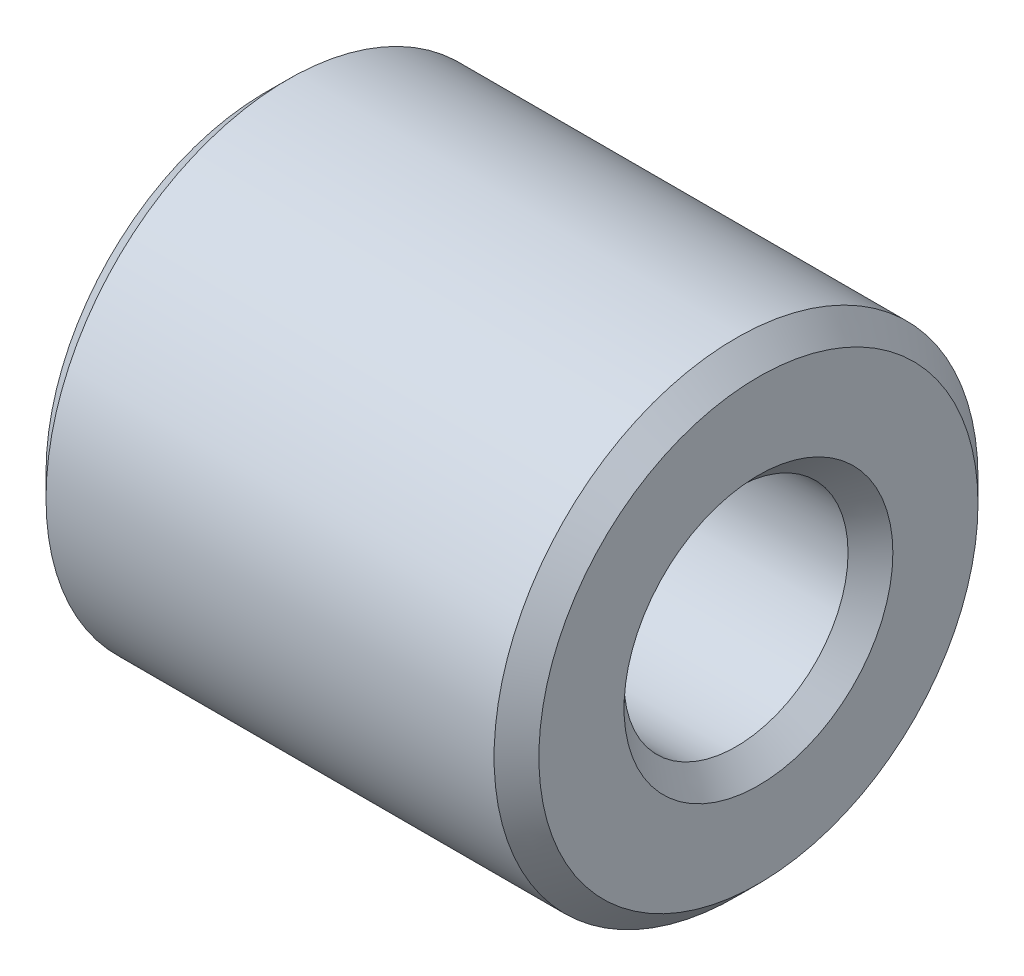
ISO-10303-21;
HEADER;
FILE_DESCRIPTION(('STEP AP214'),'2;1');
FILE_NAME('part.step','',(''),(''),'','','');
FILE_SCHEMA(('AUTOMOTIVE_DESIGN { 1 0 10303 214 1 1 1 1 }'));
ENDSEC;
DATA;
#1=APPLICATION_CONTEXT('core data for automotive mechanical design processes');
#2=APPLICATION_PROTOCOL_DEFINITION('international standard','automotive_design',2000,#1);
#3=PRODUCT_CONTEXT('',#1,'mechanical');
#4=PRODUCT('Part','Part','',(#3));
#5=PRODUCT_RELATED_PRODUCT_CATEGORY('part','',(#4));
#6=PRODUCT_DEFINITION_FORMATION('','',#4);
#7=PRODUCT_DEFINITION_CONTEXT('part definition',#1,'design');
#8=PRODUCT_DEFINITION('design','',#6,#7);
#9=PRODUCT_DEFINITION_SHAPE('','',#8);
#10=(LENGTH_UNIT() NAMED_UNIT(*) SI_UNIT(.MILLI.,.METRE.));
#11=(NAMED_UNIT(*) PLANE_ANGLE_UNIT() SI_UNIT($,.RADIAN.));
#12=(NAMED_UNIT(*) SI_UNIT($,.STERADIAN.) SOLID_ANGLE_UNIT());
#13=UNCERTAINTY_MEASURE_WITH_UNIT(LENGTH_MEASURE(1.E-05),#10,'distance_accuracy_value','');
#14=(GEOMETRIC_REPRESENTATION_CONTEXT(3) GLOBAL_UNCERTAINTY_ASSIGNED_CONTEXT((#13)) GLOBAL_UNIT_ASSIGNED_CONTEXT((#10,
#11,#12)) REPRESENTATION_CONTEXT('',''));
#15=CARTESIAN_POINT('',(0.,0.,0.));
#16=DIRECTION('',(0.,0.,1.));
#17=DIRECTION('',(1.,0.,0.));
#18=AXIS2_PLACEMENT_3D('',#15,#16,#17);
#19=CARTESIAN_POINT('',(-5.5,5.40000000000873,0.));
#20=DIRECTION('',(-1.,0.,0.));
#21=DIRECTION('',(0.,0.,1.));
#22=AXIS2_PLACEMENT_3D('',#19,#20,#21);
#23=PLANE('',#22);
#24=CARTESIAN_POINT('',(-5.5,0.,0.));
#25=DIRECTION('',(-1.,0.,0.));
#26=DIRECTION('',(0.,0.,1.));
#27=AXIS2_PLACEMENT_3D('',#24,#25,#26);
#28=CIRCLE('',#27,4.90000000000872);
#29=CARTESIAN_POINT('',(-5.5,0.,4.90000000000872));
#30=VERTEX_POINT('',#29);
#31=EDGE_CURVE('E50',#30,#30,#28,.T.);
#32=ORIENTED_EDGE('',*,*,#31,.T.);
#33=EDGE_LOOP('',(#32));
#34=FACE_BOUND('',#33,.T.);
#35=CARTESIAN_POINT('',(-5.5,0.,0.));
#36=DIRECTION('',(-1.,0.,0.));
#37=DIRECTION('',(0.,0.,1.));
#38=AXIS2_PLACEMENT_3D('',#35,#36,#37);
#39=CIRCLE('',#38,3.);
#40=CARTESIAN_POINT('',(-5.5,0.,3.));
#41=VERTEX_POINT('',#40);
#42=EDGE_CURVE('E53',#41,#41,#39,.F.);
#43=ORIENTED_EDGE('',*,*,#42,.T.);
#44=EDGE_LOOP('',(#43));
#45=FACE_BOUND('',#44,.T.);
#46=ADVANCED_FACE('F30',(#34,#45),#23,.T.);
#47=CARTESIAN_POINT('',(0.,0.,0.));
#48=DIRECTION('',(1.,0.,0.));
#49=DIRECTION('',(0.,0.,-1.));
#50=AXIS2_PLACEMENT_3D('',#47,#48,#49);
#51=CYLINDRICAL_SURFACE('',#50,2.5);
#52=CARTESIAN_POINT('',(-5.,0.,0.));
#53=DIRECTION('',(-1.,0.,0.));
#54=DIRECTION('',(0.,0.,1.));
#55=AXIS2_PLACEMENT_3D('',#52,#53,#54);
#56=CIRCLE('',#55,2.5);
#57=CARTESIAN_POINT('',(-5.,0.,2.5));
#58=VERTEX_POINT('',#57);
#59=EDGE_CURVE('E10',#58,#58,#56,.T.);
#60=ORIENTED_EDGE('',*,*,#59,.T.);
#61=EDGE_LOOP('',(#60));
#62=FACE_BOUND('',#61,.T.);
#63=CARTESIAN_POINT('',(4.99999999999999,0.,0.));
#64=DIRECTION('',(1.,0.,0.));
#65=DIRECTION('',(0.,0.,-1.));
#66=AXIS2_PLACEMENT_3D('',#63,#64,#65);
#67=CIRCLE('',#66,2.5);
#68=CARTESIAN_POINT('',(4.99999999999999,0.,-2.5));
#69=VERTEX_POINT('',#68);
#70=EDGE_CURVE('E37',#69,#69,#67,.T.);
#71=ORIENTED_EDGE('',*,*,#70,.T.);
#72=EDGE_LOOP('',(#71));
#73=FACE_BOUND('',#72,.T.);
#74=CARTESIAN_POINT('',(-2.75,-2.,1.5));
#75=CARTESIAN_POINT('',(-2.67452102471036,-1.99999416642512,1.50000404108592));
#76=CARTESIAN_POINT('',(-2.5990615659202,-2.00433633903481,1.49426852824013));
#77=CARTESIAN_POINT('',(-2.45067609603778,-2.02092590613883,1.47174965152787));
#78=CARTESIAN_POINT('',(-2.3777528126149,-2.03318155043097,1.45495475788936));
#79=CARTESIAN_POINT('',(-2.23691635832272,-2.0636233903473,1.41143486335795));
#80=CARTESIAN_POINT('',(-2.16897116196473,-2.0817666618312,1.3847815450315));
#81=CARTESIAN_POINT('',(-2.03856254663208,-2.12185904995836,1.32252909283019));
#82=CARTESIAN_POINT('',(-1.97610077030486,-2.14380930122416,1.28692729054693));
#83=CARTESIAN_POINT('',(-1.85005098333591,-2.19228594587542,1.20271292747644));
#84=CARTESIAN_POINT('',(-1.78725904287605,-2.21904371037662,1.15304179435289));
#85=CARTESIAN_POINT('',(-1.67023523725824,-2.27226229431061,1.04426801309985));
#86=CARTESIAN_POINT('',(-1.61600984832919,-2.29872287517103,0.985158296729613));
#87=CARTESIAN_POINT('',(-1.5118661902903,-2.35175567858734,0.851442367411702));
#88=CARTESIAN_POINT('',(-1.46304553633025,-2.37803133577818,0.775851995162548));
#89=CARTESIAN_POINT('',(-1.37919027755556,-2.42443786983179,0.615654228271659));
#90=CARTESIAN_POINT('',(-1.34414302587728,-2.44457437988735,0.531055196626331));
#91=CARTESIAN_POINT('',(-1.29240407718735,-2.4747098780044,0.363771406742667));
#92=CARTESIAN_POINT('',(-1.2742796390327,-2.4854930393917,0.281674698130916));
#93=CARTESIAN_POINT('',(-1.25205719713688,-2.49874939277545,0.114970509382709));
#94=CARTESIAN_POINT('',(-1.24794602199994,-2.50123038813308,0.0303654624001538));
#95=CARTESIAN_POINT('',(-1.25361374734246,-2.49783372711539,-0.127637283737309));
#96=CARTESIAN_POINT('',(-1.26173352616931,-2.49295437513726,-0.201123832865634));
#97=CARTESIAN_POINT('',(-1.2884797956481,-2.47707997553857,-0.345464269151768));
#98=CARTESIAN_POINT('',(-1.30710706390715,-2.46608447529309,-0.416317961051201));
#99=CARTESIAN_POINT('',(-1.35416556270377,-2.4388490720172,-0.554056780469079));
#100=CARTESIAN_POINT('',(-1.38265306113899,-2.42257910450824,-0.620916491037617));
#101=CARTESIAN_POINT('',(-1.44838461622554,-2.38609637638748,-0.748988660115611));
#102=CARTESIAN_POINT('',(-1.48563094705901,-2.36588259201812,-0.810199646208011));
#103=CARTESIAN_POINT('',(-1.57283909280445,-2.32037925976363,-0.933074267143199));
#104=CARTESIAN_POINT('',(-1.62378831173573,-2.2947718295215,-0.993918663198193));
#105=CARTESIAN_POINT('',(-1.73440411786017,-2.24255554245601,-1.10671465909275));
#106=CARTESIAN_POINT('',(-1.7940825034745,-2.21594536703375,-1.1586540130834));
#107=CARTESIAN_POINT('',(-1.92865340616355,-2.16111075123946,-1.25824837767417));
#108=CARTESIAN_POINT('',(-2.00450757653946,-2.13305661385124,-1.30470933188632));
#109=CARTESIAN_POINT('',(-2.1647062316366,-2.08250879557267,-1.38397217194232));
#110=CARTESIAN_POINT('',(-2.24903471612564,-2.06000490298821,-1.41679921962189));
#111=CARTESIAN_POINT('',(-2.40239363189534,-2.02895865196732,-1.46077497064842));
#112=CARTESIAN_POINT('',(-2.47004063229664,-2.01833888618316,-1.47527903312665));
#113=CARTESIAN_POINT('',(-2.60737361029948,-2.00392150777558,-1.49480872755284));
#114=CARTESIAN_POINT('',(-2.67705712048456,-2.00011596115116,-1.49984538302907));
#115=CARTESIAN_POINT('',(-2.8165516824357,-1.99988914321323,-1.50014781114183));
#116=CARTESIAN_POINT('',(-2.88636277721521,-2.00347810223984,-1.49540004697659));
#117=CARTESIAN_POINT('',(-3.02398734374855,-2.01751520788652,-1.47640290574941));
#118=CARTESIAN_POINT('',(-3.09179919224025,-2.02796877613213,-1.46214601830139));
#119=CARTESIAN_POINT('',(-3.22371457947978,-2.05431768333101,-1.42488312618657));
#120=CARTESIAN_POINT('',(-3.28782263653223,-2.07020622092812,-1.40188805257362));
#121=CARTESIAN_POINT('',(-3.41147771573018,-2.10571539417587,-1.34796261057072));
#122=CARTESIAN_POINT('',(-3.471023006366,-2.12533743689999,-1.31702924888212));
#123=CARTESIAN_POINT('',(-3.59524008251224,-2.17036819177737,-1.24167439558512));
#124=CARTESIAN_POINT('',(-3.65890083509656,-2.19618239397369,-1.19582663060303));
#125=CARTESIAN_POINT('',(-3.77828548484946,-2.24821754803621,-1.09487395518701));
#126=CARTESIAN_POINT('',(-3.83400169216911,-2.27443886711455,-1.03976018672402));
#127=CARTESIAN_POINT('',(-3.94322400735042,-2.32835625910913,-0.913274837212767));
#128=CARTESIAN_POINT('',(-3.99550072660583,-2.3558007587587,-0.840721108780193));
#129=CARTESIAN_POINT('',(-4.08690277683665,-2.40537639133459,-0.686103100868021));
#130=CARTESIAN_POINT('',(-4.12603682784092,-2.42751104449411,-0.604045176134704));
#131=CARTESIAN_POINT('',(-4.18686820343136,-2.46252280092775,-0.43884023297214));
#132=CARTESIAN_POINT('',(-4.2096262277911,-2.47595588067329,-0.35620596365126));
#133=CARTESIAN_POINT('',(-4.24071460284625,-2.494407389061,-0.187383063890858));
#134=CARTESIAN_POINT('',(-4.24906129071762,-2.49943534582737,-0.10119857178197));
#135=CARTESIAN_POINT('',(-4.25067460858592,-2.50040600461976,0.0598120232009829));
#136=CARTESIAN_POINT('',(-4.24580333456303,-2.49747057186327,0.134620583589705));
#137=CARTESIAN_POINT('',(-4.22510617561838,-2.48512948412096,0.282148755978773));
#138=CARTESIAN_POINT('',(-4.2092801686784,-2.47572375706639,0.354868344701913));
#139=CARTESIAN_POINT('',(-4.16778042841621,-2.45149427526962,0.495145481978796));
#140=CARTESIAN_POINT('',(-4.14226840387075,-2.43675966858906,0.562767032608829));
#141=CARTESIAN_POINT('',(-4.08235940544524,-2.40303337447155,0.692781971999983));
#142=CARTESIAN_POINT('',(-4.0479604391404,-2.38404073252268,0.755174184199831));
#143=CARTESIAN_POINT('',(-3.96707480343124,-2.34093432659381,0.880263645295947));
#144=CARTESIAN_POINT('',(-3.91968129098313,-2.31648844639149,0.942258690439939));
#145=CARTESIAN_POINT('',(-3.81624696628227,-2.26601907350661,1.05789751536307));
#146=CARTESIAN_POINT('',(-3.76019657439209,-2.23999385274509,1.11153190956916));
#147=CARTESIAN_POINT('',(-3.6327144378223,-2.18528165666205,1.2159097535057));
#148=CARTESIAN_POINT('',(-3.5602335138345,-2.15667566270901,1.26542406663367));
#149=CARTESIAN_POINT('',(-3.40651514723346,-2.10376464485145,1.35156817210325));
#150=CARTESIAN_POINT('',(-3.32528228601858,-2.07945738811052,1.38820466322661));
#151=CARTESIAN_POINT('',(-3.1629357148628,-2.0408000304796,1.44437116535132));
#152=CARTESIAN_POINT('',(-3.08240476403875,-2.02577665830138,1.46509526060187));
#153=CARTESIAN_POINT('',(-2.91790260529632,-2.00539032320036,1.49289268240426));
#154=CARTESIAN_POINT('',(-2.83393923424129,-2.00000648744643,1.49999550595837));
#155=CARTESIAN_POINT('',(-2.75,-2.,1.5));
#156=B_SPLINE_CURVE_WITH_KNOTS('',3,(#74,#75,#76,#77,#78,#79,#80,#81,#82,#83,#84,#85,#86,#87,
#88,#89,#90,#91,#92,#93,#94,#95,#96,#97,#98,#99,#100,#101,#102,#103,#104,#105,#106,#107,#108,
#109,#110,#111,#112,#113,#114,#115,#116,#117,#118,#119,#120,#121,#122,#123,#124,#125,#126,#127,
#128,#129,#130,#131,#132,#133,#134,#135,#136,#137,#138,#139,#140,#141,#142,#143,#144,#145,#146,
#147,#148,#149,#150,#151,#152,#153,#154,#155),.UNSPECIFIED.,.T.,.F.,(4,2,2,2,2,2,2,2,2,2,2,2,2,
2,2,2,2,2,2,2,2,2,2,2,2,2,2,2,2,2,2,2,2,2,2,2,2,2,2,2,4),(0.,0.226085249493392,0.45240657433077,
0.677113624991876,0.901887762215932,1.15414462390001,1.40659128601844,1.68630157736223,
1.9657544327122,2.21853330858497,2.47107452602766,2.69230130543181,2.91354445887944,
3.13607155036377,3.35865648368878,3.60782810055849,3.85733966656908,4.13576671140276,
4.41367760154768,4.62276298054684,4.83160475643976,5.04073566011181,5.25003193304128,
5.45906724365495,5.6681814915466,5.91499438482002,6.16204457978454,6.44121828011588,
6.72020638384847,6.97891479383337,7.23732973022726,7.46129321849399,7.68525920139648,
7.90563970188756,8.12606965394584,8.37042963549487,8.61506198741954,8.89071695766603,
9.16622832484805,9.41820120134354,9.66962780912277),.UNSPECIFIED.);
#157=CARTESIAN_POINT('',(-2.75,-2.,1.5));
#158=VERTEX_POINT('',#157);
#159=EDGE_CURVE('E62',#158,#158,#156,.T.);
#160=ORIENTED_EDGE('',*,*,#159,.F.);
#161=EDGE_LOOP('',(#160));
#162=FACE_BOUND('',#161,.T.);
#163=ADVANCED_FACE('F94',(#62,#73,#162),#51,.F.);
#164=CARTESIAN_POINT('',(5.5,2.5,0.));
#165=DIRECTION('',(1.,0.,0.));
#166=DIRECTION('',(0.,0.,-1.));
#167=AXIS2_PLACEMENT_3D('',#164,#165,#166);
#168=PLANE('',#167);
#169=CARTESIAN_POINT('',(5.5,0.,0.));
#170=DIRECTION('',(1.,0.,0.));
#171=DIRECTION('',(0.,0.,-1.));
#172=AXIS2_PLACEMENT_3D('',#169,#170,#171);
#173=CIRCLE('',#172,4.90000000000001);
#174=CARTESIAN_POINT('',(5.5,0.,-4.90000000000001));
#175=VERTEX_POINT('',#174);
#176=EDGE_CURVE('E41',#175,#175,#173,.T.);
#177=ORIENTED_EDGE('',*,*,#176,.T.);
#178=EDGE_LOOP('',(#177));
#179=FACE_BOUND('',#178,.T.);
#180=CARTESIAN_POINT('',(5.5,0.,0.));
#181=DIRECTION('',(1.,0.,0.));
#182=DIRECTION('',(0.,0.,-1.));
#183=AXIS2_PLACEMENT_3D('',#180,#181,#182);
#184=CIRCLE('',#183,3.00000000000001);
#185=CARTESIAN_POINT('',(5.5,0.,-3.00000000000001));
#186=VERTEX_POINT('',#185);
#187=EDGE_CURVE('E45',#186,#186,#184,.F.);
#188=ORIENTED_EDGE('',*,*,#187,.T.);
#189=EDGE_LOOP('',(#188));
#190=FACE_BOUND('',#189,.T.);
#191=ADVANCED_FACE('F89',(#179,#190),#168,.T.);
#192=CARTESIAN_POINT('',(0.,0.,0.));
#193=DIRECTION('',(1.,0.,0.));
#194=DIRECTION('',(0.,0.,-1.));
#195=AXIS2_PLACEMENT_3D('',#192,#193,#194);
#196=CYLINDRICAL_SURFACE('',#195,5.40000000000437);
#197=CARTESIAN_POINT('',(-5.00000000000436,0.,0.));
#198=DIRECTION('',(-1.,0.,0.));
#199=DIRECTION('',(0.,0.,1.));
#200=AXIS2_PLACEMENT_3D('',#197,#198,#199);
#201=CIRCLE('',#200,5.40000000000437);
#202=CARTESIAN_POINT('',(-5.00000000000436,0.,5.40000000000437));
#203=VERTEX_POINT('',#202);
#204=EDGE_CURVE('E56',#203,#203,#201,.F.);
#205=ORIENTED_EDGE('',*,*,#204,.T.);
#206=EDGE_LOOP('',(#205));
#207=FACE_BOUND('',#206,.T.);
#208=CARTESIAN_POINT('',(4.99999999999564,0.,0.));
#209=DIRECTION('',(1.,0.,0.));
#210=DIRECTION('',(0.,0.,-1.));
#211=AXIS2_PLACEMENT_3D('',#208,#209,#210);
#212=CIRCLE('',#211,5.40000000000437);
#213=CARTESIAN_POINT('',(4.99999999999564,0.,-5.40000000000437));
#214=VERTEX_POINT('',#213);
#215=EDGE_CURVE('E59',#214,#214,#212,.F.);
#216=ORIENTED_EDGE('',*,*,#215,.T.);
#217=EDGE_LOOP('',(#216));
#218=FACE_BOUND('',#217,.T.);
#219=CARTESIAN_POINT('',(-2.75,-5.18748493974172,1.5));
#220=CARTESIAN_POINT('',(-2.83249217197288,-5.18748622496865,1.49999828997893));
#221=CARTESIAN_POINT('',(-2.91500194404355,-5.18947416562418,1.49317186455125));
#222=CARTESIAN_POINT('',(-3.07762915725902,-5.19718484444262,1.46610416230309));
#223=CARTESIAN_POINT('',(-3.15774551316669,-5.20290925072281,1.44585689378444));
#224=CARTESIAN_POINT('',(-3.31320939605564,-5.21739561254167,1.39267205208465));
#225=CARTESIAN_POINT('',(-3.38856382445221,-5.22615304713724,1.35975335846573));
#226=CARTESIAN_POINT('',(-3.53269455323329,-5.24571285037754,1.2822202645049));
#227=CARTESIAN_POINT('',(-3.60147018457129,-5.25651542667574,1.23760467634159));
#228=CARTESIAN_POINT('',(-3.73235711334973,-5.27927689347648,1.13664919144528));
#229=CARTESIAN_POINT('',(-3.79426347058173,-5.29125765324372,1.08004846722559));
#230=CARTESIAN_POINT('',(-3.90783850342363,-5.31483743889174,0.95728972176013));
#231=CARTESIAN_POINT('',(-3.95950603997902,-5.32643642218086,0.891130638574293));
#232=CARTESIAN_POINT('',(-4.05200267669675,-5.34819121645625,0.749700257343555));
#233=CARTESIAN_POINT('',(-4.09262635510666,-5.35831823056814,0.674289796566457));
#234=CARTESIAN_POINT('',(-4.16053956425583,-5.37573610988217,0.517380217229614));
#235=CARTESIAN_POINT('',(-4.18783154274439,-5.38302749566599,0.435882219534496));
#236=CARTESIAN_POINT('',(-4.22763856728356,-5.39379791004685,0.271251816123478));
#237=CARTESIAN_POINT('',(-4.24050262535678,-5.39736682830859,0.18820978504017));
#238=CARTESIAN_POINT('',(-4.25218847399362,-5.40060520431005,0.0210746741271951));
#239=CARTESIAN_POINT('',(-4.25101280693403,-5.40027536805396,-0.0630182126537084));
#240=CARTESIAN_POINT('',(-4.2348946685697,-5.39581851824967,-0.227432548291574));
#241=CARTESIAN_POINT('',(-4.22032954161855,-5.39179558845596,-0.30779424602711));
#242=CARTESIAN_POINT('',(-4.17845771706045,-5.38052856059855,-0.464884489993547));
#243=CARTESIAN_POINT('',(-4.15115026360693,-5.37328427145216,-0.541612820403715));
#244=CARTESIAN_POINT('',(-4.08429075165008,-5.35623750364187,-0.690200155079756));
#245=CARTESIAN_POINT('',(-4.04461285428539,-5.34640890471048,-0.761999415952795));
#246=CARTESIAN_POINT('',(-3.95423623050809,-5.32524732810488,-0.898046743853025));
#247=CARTESIAN_POINT('',(-3.90353520038476,-5.31391403615982,-0.962293228104146));
#248=CARTESIAN_POINT('',(-3.79056280533357,-5.29052197936227,-1.08366405622945));
#249=CARTESIAN_POINT('',(-3.72796291661244,-5.2784516217314,-1.14048075035395));
#250=CARTESIAN_POINT('',(-3.59400039492663,-5.25528229891571,-1.24288864851073));
#251=CARTESIAN_POINT('',(-3.52263712992901,-5.24418340389377,-1.28847904216537));
#252=CARTESIAN_POINT('',(-3.3724611671524,-5.22416408366817,-1.36740142873179));
#253=CARTESIAN_POINT('',(-3.29359863841585,-5.21525988041426,-1.400643009846));
#254=CARTESIAN_POINT('',(-3.13109384254531,-5.20083613494949,-1.45329178586143));
#255=CARTESIAN_POINT('',(-3.0474528846519,-5.19531567044487,-1.47270275075953));
#256=CARTESIAN_POINT('',(-2.88065929160698,-5.18848288999461,-1.49659473291661));
#257=CARTESIAN_POINT('',(-2.79757805912314,-5.18704047793293,-1.50153749605341));
#258=CARTESIAN_POINT('',(-2.63177480573341,-5.18816993237047,-1.49763055236889));
#259=CARTESIAN_POINT('',(-2.5490527439876,-5.19074132981579,-1.48878245714788));
#260=CARTESIAN_POINT('',(-2.3881413519799,-5.19948233947086,-1.45795344857036));
#261=CARTESIAN_POINT('',(-2.30989299869018,-5.20557412095343,-1.43625635918597));
#262=CARTESIAN_POINT('',(-2.15814786374076,-5.22059198495345,-1.38066755512992));
#263=CARTESIAN_POINT('',(-2.0846517423685,-5.22951846031647,-1.34677415014729));
#264=CARTESIAN_POINT('',(-1.94258277886484,-5.24946217449307,-1.26683742729491));
#265=CARTESIAN_POINT('',(-1.87416693737686,-5.26052375913245,-1.22052640358921));
#266=CARTESIAN_POINT('',(-1.74590825355455,-5.28338999646947,-1.11739633108476));
#267=CARTESIAN_POINT('',(-1.68606716920124,-5.29519480082865,-1.06057513296388));
#268=CARTESIAN_POINT('',(-1.57470711765881,-5.31867011963912,-0.935890461880191));
#269=CARTESIAN_POINT('',(-1.52351191395924,-5.33032452777974,-0.867734159225758));
#270=CARTESIAN_POINT('',(-1.43328561735346,-5.35180441727636,-0.723529867721558));
#271=CARTESIAN_POINT('',(-1.39425387992342,-5.36162999552819,-0.647482297302964));
#272=CARTESIAN_POINT('',(-1.32983024490591,-5.37828196672925,-0.490187037139812));
#273=CARTESIAN_POINT('',(-1.30433530035963,-5.38513094388068,-0.408984060630256));
#274=CARTESIAN_POINT('',(-1.26741909593552,-5.39515765703777,-0.243225787737071));
#275=CARTESIAN_POINT('',(-1.25599443011381,-5.39833628150143,-0.158671307757621));
#276=CARTESIAN_POINT('',(-1.24777140218823,-5.40061825326042,0.00837609141473693));
#277=CARTESIAN_POINT('',(-1.25049997574563,-5.39985341392262,0.0908442387539525));
#278=CARTESIAN_POINT('',(-1.26939713749437,-5.39463653308314,0.254100371836764));
#279=CARTESIAN_POINT('',(-1.28556514254192,-5.39018465156415,0.334888430324377));
#280=CARTESIAN_POINT('',(-1.33060593417708,-5.37812390455248,0.491870990081798));
#281=CARTESIAN_POINT('',(-1.35937555876034,-5.37054070162526,0.568097193769064));
#282=CARTESIAN_POINT('',(-1.42871116293844,-5.35300692178699,0.714683524729812));
#283=CARTESIAN_POINT('',(-1.46927890002601,-5.34305599221037,0.785042776028537));
#284=CARTESIAN_POINT('',(-1.5624031656308,-5.32149238409908,0.920070673038475));
#285=CARTESIAN_POINT('',(-1.6152680516461,-5.30984047043841,0.984520359885339));
#286=CARTESIAN_POINT('',(-1.73091075826628,-5.28633552481111,1.10379338143919));
#287=CARTESIAN_POINT('',(-1.79369125881077,-5.27448243924807,1.15861410519644));
#288=CARTESIAN_POINT('',(-1.92922671048298,-5.25158132130768,1.25840545145803));
#289=CARTESIAN_POINT('',(-2.00218783378422,-5.24056002364518,1.30310278053283));
#290=CARTESIAN_POINT('',(-2.15488639237315,-5.22096231494335,1.37953591591594));
#291=CARTESIAN_POINT('',(-2.23461972392625,-5.21238443680146,1.41127950501387));
#292=CARTESIAN_POINT('',(-2.38661607783051,-5.19972807453774,1.45715696928586));
#293=CARTESIAN_POINT('',(-2.45827364333058,-5.19517596404652,1.4731833804337));
#294=CARTESIAN_POINT('',(-2.60328298893804,-5.18905403082368,1.49460492295236));
#295=CARTESIAN_POINT('',(-2.67663453392844,-5.18748379670874,1.50000152082906));
#296=CARTESIAN_POINT('',(-2.75,-5.18748493974172,1.5));
#297=B_SPLINE_CURVE_WITH_KNOTS('',3,(#219,#220,#221,#222,#223,#224,#225,#226,#227,#228,#229,
#230,#231,#232,#233,#234,#235,#236,#237,#238,#239,#240,#241,#242,#243,#244,#245,#246,#247,#248,
#249,#250,#251,#252,#253,#254,#255,#256,#257,#258,#259,#260,#261,#262,#263,#264,#265,#266,#267,
#268,#269,#270,#271,#272,#273,#274,#275,#276,#277,#278,#279,#280,#281,#282,#283,#284,#285,#286,
#287,#288,#289,#290,#291,#292,#293,#294,#295,#296),.UNSPECIFIED.,.T.,.F.,(4,2,2,2,2,2,2,2,2,2,2,
2,2,2,2,2,2,2,2,2,2,2,2,2,2,2,2,2,2,2,2,2,2,2,2,2,2,2,4),(0.,0.247206475013384,
0.494523389072726,0.74147323516717,0.988448168775734,1.24148337456022,1.49454671437447,
1.75203718050381,2.00948035264756,2.26055178734846,2.51157775759035,2.75573920510853,
2.99991513758438,3.24666079982064,3.49345807877747,3.74845725330897,4.00347482972527,
4.26032434444616,4.51710381943139,4.76559382658774,5.01405479736817,5.25722206615908,
5.50042304896036,5.74936000582743,5.99834792649559,6.25522503755615,6.51208853476869,
6.76696759518504,7.02178494577107,7.26814118838277,7.51448674202904,7.75885223919389,
8.00325415665561,8.25461213670037,8.50603816906631,8.76360527674968,9.02101740583075,
9.24090397774495,9.4607602116337),.UNSPECIFIED.);
#298=CARTESIAN_POINT('',(-2.75,-5.18748493974172,1.5));
#299=VERTEX_POINT('',#298);
#300=EDGE_CURVE('E63',#299,#299,#297,.T.);
#301=ORIENTED_EDGE('',*,*,#300,.F.);
#302=EDGE_LOOP('',(#301));
#303=FACE_BOUND('',#302,.T.);
#304=ADVANCED_FACE('F73',(#207,#218,#303),#196,.T.);
#305=CARTESIAN_POINT('',(-2.75,-10.,0.));
#306=DIRECTION('',(0.,1.,0.));
#307=DIRECTION('',(0.,0.,1.));
#308=AXIS2_PLACEMENT_3D('',#305,#306,#307);
#309=CYLINDRICAL_SURFACE('',#308,1.5);
#310=ORIENTED_EDGE('',*,*,#159,.T.);
#311=EDGE_LOOP('',(#310));
#312=FACE_BOUND('',#311,.T.);
#313=ORIENTED_EDGE('',*,*,#300,.T.);
#314=EDGE_LOOP('',(#313));
#315=FACE_BOUND('',#314,.T.);
#316=ADVANCED_FACE('F76',(#312,#315),#309,.F.);
#317=CARTESIAN_POINT('',(-5.00000000000436,0.,0.));
#318=DIRECTION('',(1.,0.,0.));
#319=DIRECTION('',(0.,0.,-1.));
#320=AXIS2_PLACEMENT_3D('',#317,#318,#319);
#321=CONICAL_SURFACE('',#320,5.40000000000437,0.785398163397448);
#322=ORIENTED_EDGE('',*,*,#31,.F.);
#323=EDGE_LOOP('',(#322));
#324=FACE_BOUND('',#323,.T.);
#325=ORIENTED_EDGE('',*,*,#204,.F.);
#326=EDGE_LOOP('',(#325));
#327=FACE_BOUND('',#326,.T.);
#328=ADVANCED_FACE('F79',(#324,#327),#321,.T.);
#329=CARTESIAN_POINT('',(5.5,0.,0.));
#330=DIRECTION('',(-1.,0.,0.));
#331=DIRECTION('',(0.,0.,1.));
#332=AXIS2_PLACEMENT_3D('',#329,#330,#331);
#333=CONICAL_SURFACE('',#332,4.90000000000001,0.785398163397448);
#334=ORIENTED_EDGE('',*,*,#215,.F.);
#335=EDGE_LOOP('',(#334));
#336=FACE_BOUND('',#335,.T.);
#337=ORIENTED_EDGE('',*,*,#176,.F.);
#338=EDGE_LOOP('',(#337));
#339=FACE_BOUND('',#338,.T.);
#340=ADVANCED_FACE('F86',(#336,#339),#333,.T.);
#341=CARTESIAN_POINT('',(-5.5,0.,0.));
#342=DIRECTION('',(-1.,0.,0.));
#343=DIRECTION('',(0.,0.,1.));
#344=AXIS2_PLACEMENT_3D('',#341,#342,#343);
#345=CONICAL_SURFACE('',#344,3.,0.785398163397446);
#346=ORIENTED_EDGE('',*,*,#59,.F.);
#347=EDGE_LOOP('',(#346));
#348=FACE_BOUND('',#347,.T.);
#349=ORIENTED_EDGE('',*,*,#42,.F.);
#350=EDGE_LOOP('',(#349));
#351=FACE_BOUND('',#350,.T.);
#352=ADVANCED_FACE('F104',(#348,#351),#345,.F.);
#353=CARTESIAN_POINT('',(4.99999999999999,0.,0.));
#354=DIRECTION('',(1.,0.,0.));
#355=DIRECTION('',(0.,0.,-1.));
#356=AXIS2_PLACEMENT_3D('',#353,#354,#355);
#357=CONICAL_SURFACE('',#356,2.5,0.785398163397453);
#358=ORIENTED_EDGE('',*,*,#187,.F.);
#359=EDGE_LOOP('',(#358));
#360=FACE_BOUND('',#359,.T.);
#361=ORIENTED_EDGE('',*,*,#70,.F.);
#362=EDGE_LOOP('',(#361));
#363=FACE_BOUND('',#362,.T.);
#364=ADVANCED_FACE('F32',(#360,#363),#357,.F.);
#365=CLOSED_SHELL('',(#46,#163,#191,#304,#316,#328,#340,#352,#364));
#366=MANIFOLD_SOLID_BREP('B2',#365);
#367=ADVANCED_BREP_SHAPE_REPRESENTATION('',(#18,#366),#14);
#368=SHAPE_DEFINITION_REPRESENTATION(#9,#367);
ENDSEC;
END-ISO-10303-21;
